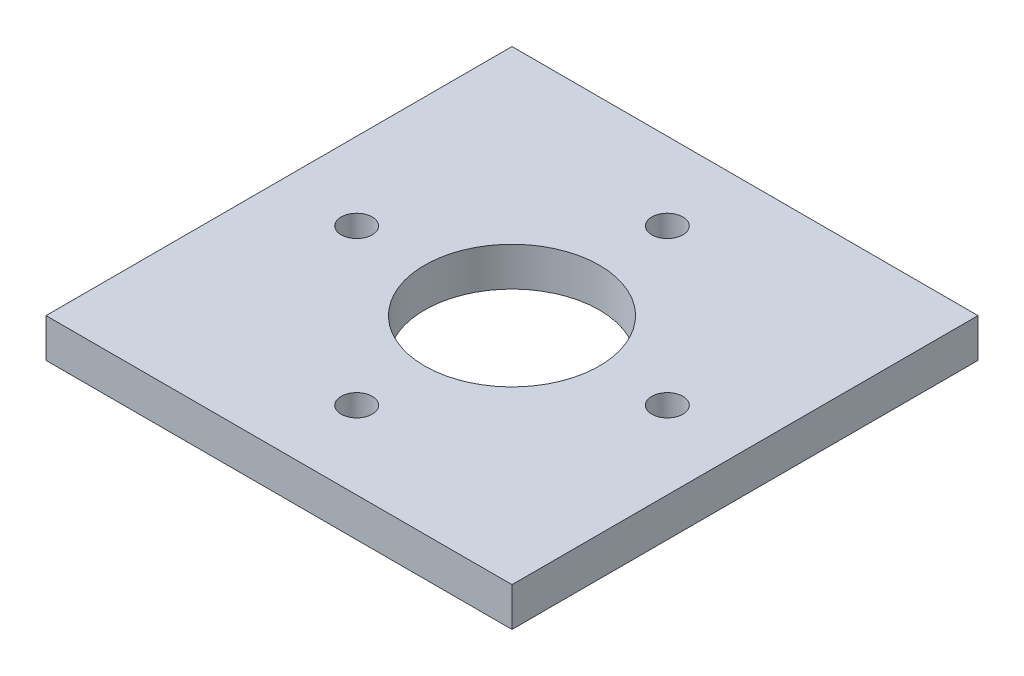
ISO-10303-21;
HEADER;
FILE_DESCRIPTION(('STEP AP214'),'2;1');
FILE_NAME('part.step','',(''),(''),'','','');
FILE_SCHEMA(('AUTOMOTIVE_DESIGN { 1 0 10303 214 1 1 1 1 }'));
ENDSEC;
DATA;
#1=APPLICATION_CONTEXT('core data for automotive mechanical design processes');
#2=APPLICATION_PROTOCOL_DEFINITION('international standard','automotive_design',2000,#1);
#3=PRODUCT_CONTEXT('',#1,'mechanical');
#4=PRODUCT('Part','Part','',(#3));
#5=PRODUCT_RELATED_PRODUCT_CATEGORY('part','',(#4));
#6=PRODUCT_DEFINITION_FORMATION('','',#4);
#7=PRODUCT_DEFINITION_CONTEXT('part definition',#1,'design');
#8=PRODUCT_DEFINITION('design','',#6,#7);
#9=PRODUCT_DEFINITION_SHAPE('','',#8);
#10=(LENGTH_UNIT() NAMED_UNIT(*) SI_UNIT(.MILLI.,.METRE.));
#11=(NAMED_UNIT(*) PLANE_ANGLE_UNIT() SI_UNIT($,.RADIAN.));
#12=(NAMED_UNIT(*) SI_UNIT($,.STERADIAN.) SOLID_ANGLE_UNIT());
#13=UNCERTAINTY_MEASURE_WITH_UNIT(LENGTH_MEASURE(1.E-05),#10,'distance_accuracy_value','');
#14=(GEOMETRIC_REPRESENTATION_CONTEXT(3) GLOBAL_UNCERTAINTY_ASSIGNED_CONTEXT((#13)) GLOBAL_UNIT_ASSIGNED_CONTEXT((#10,
#11,#12)) REPRESENTATION_CONTEXT('',''));
#15=CARTESIAN_POINT('',(0.,0.,0.));
#16=DIRECTION('',(0.,0.,1.));
#17=DIRECTION('',(1.,0.,0.));
#18=AXIS2_PLACEMENT_3D('',#15,#16,#17);
#19=CARTESIAN_POINT('',(-2.66050878019847E-13,6.35,-25.4));
#20=DIRECTION('',(0.,-1.,0.));
#21=DIRECTION('',(1.,0.,0.));
#22=AXIS2_PLACEMENT_3D('',#19,#20,#21);
#23=CYLINDRICAL_SURFACE('',#22,2.54);
#24=CARTESIAN_POINT('',(-2.66050878019847E-13,6.35,-25.4));
#25=DIRECTION('',(0.,1.,0.));
#26=DIRECTION('',(-1.,0.,0.));
#27=AXIS2_PLACEMENT_3D('',#24,#25,#26);
#28=CIRCLE('',#27,2.54);
#29=CARTESIAN_POINT('',(-2.54000000000027,6.35,-25.4));
#30=VERTEX_POINT('',#29);
#31=EDGE_CURVE('E50',#30,#30,#28,.T.);
#32=ORIENTED_EDGE('',*,*,#31,.T.);
#33=EDGE_LOOP('',(#32));
#34=FACE_BOUND('',#33,.T.);
#35=CARTESIAN_POINT('',(-2.66050878019847E-13,0.,-25.4));
#36=DIRECTION('',(0.,1.,0.));
#37=DIRECTION('',(-1.,0.,0.));
#38=AXIS2_PLACEMENT_3D('',#35,#36,#37);
#39=CIRCLE('',#38,2.54);
#40=CARTESIAN_POINT('',(-2.54000000000027,0.,-25.4));
#41=VERTEX_POINT('',#40);
#42=EDGE_CURVE('E11',#41,#41,#39,.T.);
#43=ORIENTED_EDGE('',*,*,#42,.F.);
#44=EDGE_LOOP('',(#43));
#45=FACE_BOUND('',#44,.T.);
#46=ADVANCED_FACE('F39',(#34,#45),#23,.F.);
#47=CARTESIAN_POINT('',(25.4,6.35,0.));
#48=DIRECTION('',(0.,-1.,0.));
#49=DIRECTION('',(0.,0.,1.));
#50=AXIS2_PLACEMENT_3D('',#47,#48,#49);
#51=CYLINDRICAL_SURFACE('',#50,2.54);
#52=CARTESIAN_POINT('',(25.4,6.35,0.));
#53=DIRECTION('',(0.,1.,0.));
#54=DIRECTION('',(0.,0.,-1.));
#55=AXIS2_PLACEMENT_3D('',#52,#53,#54);
#56=CIRCLE('',#55,2.54);
#57=CARTESIAN_POINT('',(25.4,6.35,-2.54));
#58=VERTEX_POINT('',#57);
#59=EDGE_CURVE('E121',#58,#58,#56,.T.);
#60=ORIENTED_EDGE('',*,*,#59,.T.);
#61=EDGE_LOOP('',(#60));
#62=FACE_BOUND('',#61,.T.);
#63=CARTESIAN_POINT('',(25.4,0.,0.));
#64=DIRECTION('',(0.,1.,0.));
#65=DIRECTION('',(0.,0.,-1.));
#66=AXIS2_PLACEMENT_3D('',#63,#64,#65);
#67=CIRCLE('',#66,2.54);
#68=CARTESIAN_POINT('',(25.4,0.,-2.54));
#69=VERTEX_POINT('',#68);
#70=EDGE_CURVE('E128',#69,#69,#67,.T.);
#71=ORIENTED_EDGE('',*,*,#70,.F.);
#72=EDGE_LOOP('',(#71));
#73=FACE_BOUND('',#72,.T.);
#74=ADVANCED_FACE('F143',(#62,#73),#51,.F.);
#75=CARTESIAN_POINT('',(0.,6.35,25.4));
#76=DIRECTION('',(0.,-1.,0.));
#77=DIRECTION('',(-1.,0.,0.));
#78=AXIS2_PLACEMENT_3D('',#75,#76,#77);
#79=CYLINDRICAL_SURFACE('',#78,2.54);
#80=CARTESIAN_POINT('',(0.,6.35,25.4));
#81=DIRECTION('',(0.,1.,0.));
#82=DIRECTION('',(1.,0.,0.));
#83=AXIS2_PLACEMENT_3D('',#80,#81,#82);
#84=CIRCLE('',#83,2.54);
#85=CARTESIAN_POINT('',(2.54000000000009,6.35,25.4));
#86=VERTEX_POINT('',#85);
#87=EDGE_CURVE('E119',#86,#86,#84,.T.);
#88=ORIENTED_EDGE('',*,*,#87,.T.);
#89=EDGE_LOOP('',(#88));
#90=FACE_BOUND('',#89,.T.);
#91=CARTESIAN_POINT('',(0.,0.,25.4));
#92=DIRECTION('',(0.,1.,0.));
#93=DIRECTION('',(1.,0.,0.));
#94=AXIS2_PLACEMENT_3D('',#91,#92,#93);
#95=CIRCLE('',#94,2.54);
#96=CARTESIAN_POINT('',(2.54000000000009,0.,25.4));
#97=VERTEX_POINT('',#96);
#98=EDGE_CURVE('E118',#97,#97,#95,.T.);
#99=ORIENTED_EDGE('',*,*,#98,.F.);
#100=EDGE_LOOP('',(#99));
#101=FACE_BOUND('',#100,.T.);
#102=ADVANCED_FACE('F136',(#90,#101),#79,.F.);
#103=CARTESIAN_POINT('',(0.,6.35,0.));
#104=DIRECTION('',(0.,-1.,0.));
#105=DIRECTION('',(0.,0.,-1.));
#106=AXIS2_PLACEMENT_3D('',#103,#104,#105);
#107=PLANE('',#106);
#108=ORIENTED_EDGE('',*,*,#31,.F.);
#109=EDGE_LOOP('',(#108));
#110=FACE_BOUND('',#109,.T.);
#111=ORIENTED_EDGE('',*,*,#59,.F.);
#112=EDGE_LOOP('',(#111));
#113=FACE_BOUND('',#112,.T.);
#114=ORIENTED_EDGE('',*,*,#87,.F.);
#115=EDGE_LOOP('',(#114));
#116=FACE_BOUND('',#115,.T.);
#117=DIRECTION('',(0.,0.,-1.));
#118=VECTOR('',#117,1.);
#119=CARTESIAN_POINT('',(38.1,6.35,38.1));
#120=LINE('',#119,#118);
#121=CARTESIAN_POINT('',(38.1,6.35,38.1));
#122=VERTEX_POINT('',#121);
#123=CARTESIAN_POINT('',(38.1,6.35,-38.1));
#124=VERTEX_POINT('',#123);
#125=EDGE_CURVE('E95',#122,#124,#120,.T.);
#126=ORIENTED_EDGE('',*,*,#125,.T.);
#127=DIRECTION('',(-1.,0.,0.));
#128=VECTOR('',#127,1.);
#129=CARTESIAN_POINT('',(-38.1,6.35,-38.1));
#130=LINE('',#129,#128);
#131=CARTESIAN_POINT('',(-38.1,6.35,-38.1));
#132=VERTEX_POINT('',#131);
#133=EDGE_CURVE('E86',#124,#132,#130,.T.);
#134=ORIENTED_EDGE('',*,*,#133,.T.);
#135=DIRECTION('',(0.,0.,1.));
#136=VECTOR('',#135,1.);
#137=CARTESIAN_POINT('',(-38.1,6.35,38.1));
#138=LINE('',#137,#136);
#139=CARTESIAN_POINT('',(-38.1,6.35,38.1));
#140=VERTEX_POINT('',#139);
#141=EDGE_CURVE('E89',#132,#140,#138,.T.);
#142=ORIENTED_EDGE('',*,*,#141,.T.);
#143=DIRECTION('',(1.,0.,0.));
#144=VECTOR('',#143,1.);
#145=CARTESIAN_POINT('',(-38.1,6.35,38.1));
#146=LINE('',#145,#144);
#147=EDGE_CURVE('E54',#140,#122,#146,.T.);
#148=ORIENTED_EDGE('',*,*,#147,.T.);
#149=EDGE_LOOP('',(#126,#134,#142,#148));
#150=FACE_BOUND('',#149,.T.);
#151=CARTESIAN_POINT('',(0.,6.35,0.));
#152=DIRECTION('',(0.,1.,0.));
#153=DIRECTION('',(0.,0.,1.));
#154=AXIS2_PLACEMENT_3D('',#151,#152,#153);
#155=CIRCLE('',#154,14.2875);
#156=CARTESIAN_POINT('',(0.,6.35,14.2875));
#157=VERTEX_POINT('',#156);
#158=EDGE_CURVE('E108',#157,#157,#155,.T.);
#159=ORIENTED_EDGE('',*,*,#158,.F.);
#160=EDGE_LOOP('',(#159));
#161=FACE_BOUND('',#160,.T.);
#162=CARTESIAN_POINT('',(-25.4,6.35,0.));
#163=DIRECTION('',(0.,1.,0.));
#164=DIRECTION('',(0.,0.,1.));
#165=AXIS2_PLACEMENT_3D('',#162,#163,#164);
#166=CIRCLE('',#165,2.54);
#167=CARTESIAN_POINT('',(-25.4,6.35,2.54));
#168=VERTEX_POINT('',#167);
#169=EDGE_CURVE('E165',#168,#168,#166,.T.);
#170=ORIENTED_EDGE('',*,*,#169,.F.);
#171=EDGE_LOOP('',(#170));
#172=FACE_BOUND('',#171,.T.);
#173=ADVANCED_FACE('F90',(#110,#113,#116,#150,#161,#172),#107,.F.);
#174=CARTESIAN_POINT('',(0.,0.,0.));
#175=DIRECTION('',(0.,-1.,0.));
#176=DIRECTION('',(0.,0.,-1.));
#177=AXIS2_PLACEMENT_3D('',#174,#175,#176);
#178=PLANE('',#177);
#179=ORIENTED_EDGE('',*,*,#42,.T.);
#180=EDGE_LOOP('',(#179));
#181=FACE_BOUND('',#180,.T.);
#182=ORIENTED_EDGE('',*,*,#70,.T.);
#183=EDGE_LOOP('',(#182));
#184=FACE_BOUND('',#183,.T.);
#185=ORIENTED_EDGE('',*,*,#98,.T.);
#186=EDGE_LOOP('',(#185));
#187=FACE_BOUND('',#186,.T.);
#188=CARTESIAN_POINT('',(0.,0.,0.));
#189=DIRECTION('',(0.,1.,0.));
#190=DIRECTION('',(0.,0.,1.));
#191=AXIS2_PLACEMENT_3D('',#188,#189,#190);
#192=CIRCLE('',#191,14.2875);
#193=CARTESIAN_POINT('',(0.,0.,14.2875));
#194=VERTEX_POINT('',#193);
#195=EDGE_CURVE('E157',#194,#194,#192,.T.);
#196=ORIENTED_EDGE('',*,*,#195,.T.);
#197=EDGE_LOOP('',(#196));
#198=FACE_BOUND('',#197,.T.);
#199=DIRECTION('',(0.,0.,-1.));
#200=VECTOR('',#199,1.);
#201=CARTESIAN_POINT('',(38.1,0.,38.1));
#202=LINE('',#201,#200);
#203=CARTESIAN_POINT('',(38.1,0.,38.1));
#204=VERTEX_POINT('',#203);
#205=CARTESIAN_POINT('',(38.1,0.,-38.1));
#206=VERTEX_POINT('',#205);
#207=EDGE_CURVE('E109',#204,#206,#202,.T.);
#208=ORIENTED_EDGE('',*,*,#207,.F.);
#209=DIRECTION('',(1.,0.,0.));
#210=VECTOR('',#209,1.);
#211=CARTESIAN_POINT('',(-38.1,0.,38.1));
#212=LINE('',#211,#210);
#213=CARTESIAN_POINT('',(-38.1,0.,38.1));
#214=VERTEX_POINT('',#213);
#215=EDGE_CURVE('E76',#214,#204,#212,.T.);
#216=ORIENTED_EDGE('',*,*,#215,.F.);
#217=DIRECTION('',(0.,0.,1.));
#218=VECTOR('',#217,1.);
#219=CARTESIAN_POINT('',(-38.1,0.,38.1));
#220=LINE('',#219,#218);
#221=CARTESIAN_POINT('',(-38.1,0.,-38.1));
#222=VERTEX_POINT('',#221);
#223=EDGE_CURVE('E74',#222,#214,#220,.T.);
#224=ORIENTED_EDGE('',*,*,#223,.F.);
#225=DIRECTION('',(-1.,0.,0.));
#226=VECTOR('',#225,1.);
#227=CARTESIAN_POINT('',(-38.1,0.,-38.1));
#228=LINE('',#227,#226);
#229=EDGE_CURVE('E100',#206,#222,#228,.T.);
#230=ORIENTED_EDGE('',*,*,#229,.F.);
#231=EDGE_LOOP('',(#208,#216,#224,#230));
#232=FACE_BOUND('',#231,.T.);
#233=CARTESIAN_POINT('',(-25.4,0.,0.));
#234=DIRECTION('',(0.,1.,0.));
#235=DIRECTION('',(0.,0.,1.));
#236=AXIS2_PLACEMENT_3D('',#233,#234,#235);
#237=CIRCLE('',#236,2.54);
#238=CARTESIAN_POINT('',(-25.4,0.,2.54));
#239=VERTEX_POINT('',#238);
#240=EDGE_CURVE('E162',#239,#239,#237,.T.);
#241=ORIENTED_EDGE('',*,*,#240,.T.);
#242=EDGE_LOOP('',(#241));
#243=FACE_BOUND('',#242,.T.);
#244=ADVANCED_FACE('F134',(#181,#184,#187,#198,#232,#243),#178,.T.);
#245=CARTESIAN_POINT('',(38.1,6.35,38.1));
#246=DIRECTION('',(-1.,0.,0.));
#247=DIRECTION('',(0.,0.,1.));
#248=AXIS2_PLACEMENT_3D('',#245,#246,#247);
#249=PLANE('',#248);
#250=ORIENTED_EDGE('',*,*,#207,.T.);
#251=DIRECTION('',(0.,-1.,0.));
#252=VECTOR('',#251,1.);
#253=CARTESIAN_POINT('',(38.1,6.35,-38.1));
#254=LINE('',#253,#252);
#255=EDGE_CURVE('E97',#124,#206,#254,.T.);
#256=ORIENTED_EDGE('',*,*,#255,.F.);
#257=ORIENTED_EDGE('',*,*,#125,.F.);
#258=DIRECTION('',(0.,-1.,0.));
#259=VECTOR('',#258,1.);
#260=CARTESIAN_POINT('',(38.1,6.35,38.1));
#261=LINE('',#260,#259);
#262=EDGE_CURVE('E104',#122,#204,#261,.T.);
#263=ORIENTED_EDGE('',*,*,#262,.T.);
#264=EDGE_LOOP('',(#250,#256,#257,#263));
#265=FACE_BOUND('',#264,.T.);
#266=ADVANCED_FACE('F148',(#265),#249,.F.);
#267=CARTESIAN_POINT('',(-38.1,6.35,-38.1));
#268=DIRECTION('',(0.,0.,1.));
#269=DIRECTION('',(1.,0.,0.));
#270=AXIS2_PLACEMENT_3D('',#267,#268,#269);
#271=PLANE('',#270);
#272=ORIENTED_EDGE('',*,*,#229,.T.);
#273=DIRECTION('',(0.,-1.,0.));
#274=VECTOR('',#273,1.);
#275=CARTESIAN_POINT('',(-38.1,6.35,-38.1));
#276=LINE('',#275,#274);
#277=EDGE_CURVE('E94',#132,#222,#276,.T.);
#278=ORIENTED_EDGE('',*,*,#277,.F.);
#279=ORIENTED_EDGE('',*,*,#133,.F.);
#280=ORIENTED_EDGE('',*,*,#255,.T.);
#281=EDGE_LOOP('',(#272,#278,#279,#280));
#282=FACE_BOUND('',#281,.T.);
#283=ADVANCED_FACE('F96',(#282),#271,.F.);
#284=CARTESIAN_POINT('',(-38.1,6.35,38.1));
#285=DIRECTION('',(1.,0.,0.));
#286=DIRECTION('',(0.,0.,-1.));
#287=AXIS2_PLACEMENT_3D('',#284,#285,#286);
#288=PLANE('',#287);
#289=ORIENTED_EDGE('',*,*,#223,.T.);
#290=DIRECTION('',(0.,-1.,0.));
#291=VECTOR('',#290,1.);
#292=CARTESIAN_POINT('',(-38.1,6.35,38.1));
#293=LINE('',#292,#291);
#294=EDGE_CURVE('E98',#140,#214,#293,.T.);
#295=ORIENTED_EDGE('',*,*,#294,.F.);
#296=ORIENTED_EDGE('',*,*,#141,.F.);
#297=ORIENTED_EDGE('',*,*,#277,.T.);
#298=EDGE_LOOP('',(#289,#295,#296,#297));
#299=FACE_BOUND('',#298,.T.);
#300=ADVANCED_FACE('F102',(#299),#288,.F.);
#301=CARTESIAN_POINT('',(-38.1,6.35,38.1));
#302=DIRECTION('',(0.,0.,-1.));
#303=DIRECTION('',(-1.,0.,0.));
#304=AXIS2_PLACEMENT_3D('',#301,#302,#303);
#305=PLANE('',#304);
#306=ORIENTED_EDGE('',*,*,#215,.T.);
#307=ORIENTED_EDGE('',*,*,#262,.F.);
#308=ORIENTED_EDGE('',*,*,#147,.F.);
#309=ORIENTED_EDGE('',*,*,#294,.T.);
#310=EDGE_LOOP('',(#306,#307,#308,#309));
#311=FACE_BOUND('',#310,.T.);
#312=ADVANCED_FACE('F182',(#311),#305,.F.);
#313=CARTESIAN_POINT('',(0.,6.35,0.));
#314=DIRECTION('',(0.,-1.,0.));
#315=DIRECTION('',(0.,0.,-1.));
#316=AXIS2_PLACEMENT_3D('',#313,#314,#315);
#317=CYLINDRICAL_SURFACE('',#316,14.2875);
#318=ORIENTED_EDGE('',*,*,#158,.T.);
#319=EDGE_LOOP('',(#318));
#320=FACE_BOUND('',#319,.T.);
#321=ORIENTED_EDGE('',*,*,#195,.F.);
#322=EDGE_LOOP('',(#321));
#323=FACE_BOUND('',#322,.T.);
#324=ADVANCED_FACE('F175',(#320,#323),#317,.F.);
#325=CARTESIAN_POINT('',(-25.4,6.35,0.));
#326=DIRECTION('',(0.,-1.,0.));
#327=DIRECTION('',(0.,0.,-1.));
#328=AXIS2_PLACEMENT_3D('',#325,#326,#327);
#329=CYLINDRICAL_SURFACE('',#328,2.54);
#330=ORIENTED_EDGE('',*,*,#169,.T.);
#331=EDGE_LOOP('',(#330));
#332=FACE_BOUND('',#331,.T.);
#333=ORIENTED_EDGE('',*,*,#240,.F.);
#334=EDGE_LOOP('',(#333));
#335=FACE_BOUND('',#334,.T.);
#336=ADVANCED_FACE('F180',(#332,#335),#329,.F.);
#337=CLOSED_SHELL('',(#46,#74,#102,#173,#244,#266,#283,#300,#312,#324,#336));
#338=MANIFOLD_SOLID_BREP('B2',#337);
#339=ADVANCED_BREP_SHAPE_REPRESENTATION('',(#18,#338),#14);
#340=SHAPE_DEFINITION_REPRESENTATION(#9,#339);
ENDSEC;
END-ISO-10303-21;
